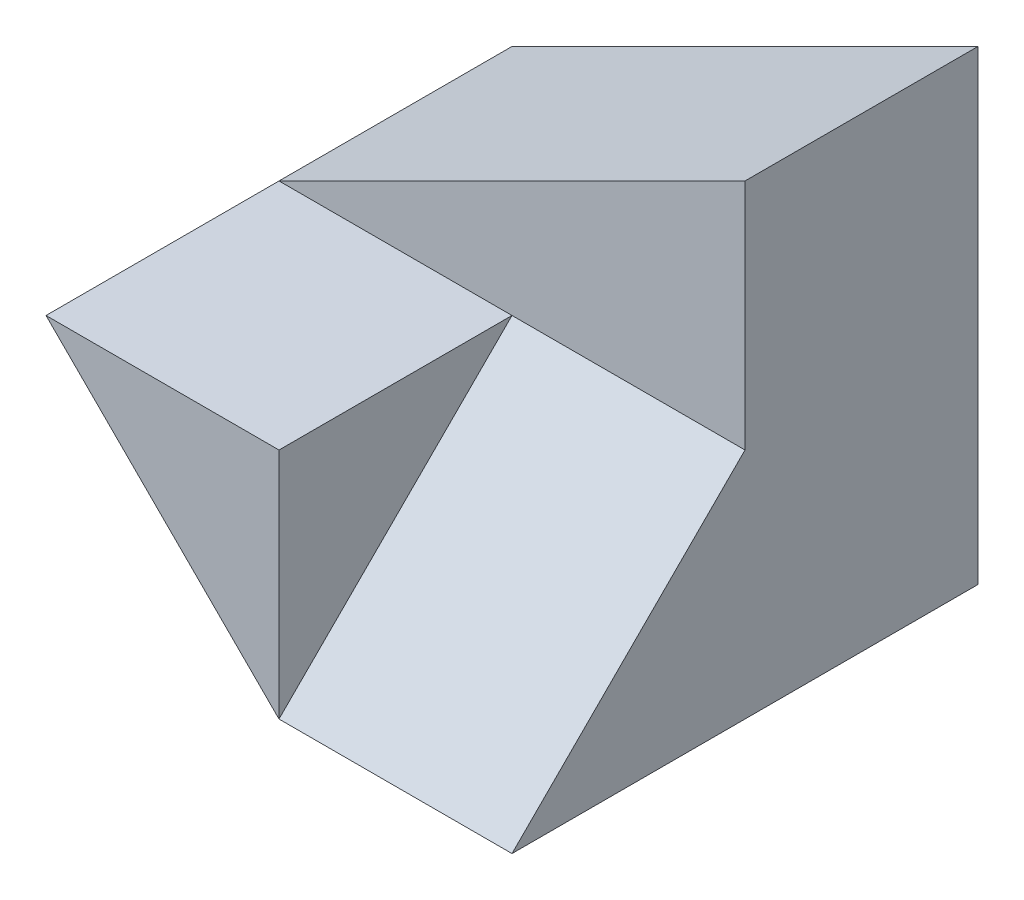
ISO-10303-21;
HEADER;
FILE_DESCRIPTION(('STEP AP214'),'2;1');
FILE_NAME('part.step','',(''),(''),'','','');
FILE_SCHEMA(('AUTOMOTIVE_DESIGN { 1 0 10303 214 1 1 1 1 }'));
ENDSEC;
DATA;
#1=APPLICATION_CONTEXT('core data for automotive mechanical design processes');
#2=APPLICATION_PROTOCOL_DEFINITION('international standard','automotive_design',2000,#1);
#3=PRODUCT_CONTEXT('',#1,'mechanical');
#4=PRODUCT('Part','Part','',(#3));
#5=PRODUCT_RELATED_PRODUCT_CATEGORY('part','',(#4));
#6=PRODUCT_DEFINITION_FORMATION('','',#4);
#7=PRODUCT_DEFINITION_CONTEXT('part definition',#1,'design');
#8=PRODUCT_DEFINITION('design','',#6,#7);
#9=PRODUCT_DEFINITION_SHAPE('','',#8);
#10=(LENGTH_UNIT() NAMED_UNIT(*) SI_UNIT(.MILLI.,.METRE.));
#11=(NAMED_UNIT(*) PLANE_ANGLE_UNIT() SI_UNIT($,.RADIAN.));
#12=(NAMED_UNIT(*) SI_UNIT($,.STERADIAN.) SOLID_ANGLE_UNIT());
#13=UNCERTAINTY_MEASURE_WITH_UNIT(LENGTH_MEASURE(1.E-05),#10,'distance_accuracy_value','');
#14=(GEOMETRIC_REPRESENTATION_CONTEXT(3) GLOBAL_UNCERTAINTY_ASSIGNED_CONTEXT((#13)) GLOBAL_UNIT_ASSIGNED_CONTEXT((#10,
#11,#12)) REPRESENTATION_CONTEXT('',''));
#15=CARTESIAN_POINT('',(0.,0.,0.));
#16=DIRECTION('',(0.,0.,1.));
#17=DIRECTION('',(1.,0.,0.));
#18=AXIS2_PLACEMENT_3D('',#15,#16,#17);
#19=CARTESIAN_POINT('',(0.,0.,40.));
#20=DIRECTION('',(0.,0.,-1.));
#21=DIRECTION('',(-1.,0.,0.));
#22=AXIS2_PLACEMENT_3D('',#19,#20,#21);
#23=PLANE('',#22);
#24=DIRECTION('',(0.,-1.,0.));
#25=VECTOR('',#24,1.);
#26=CARTESIAN_POINT('',(20.,0.,40.));
#27=LINE('',#26,#25);
#28=CARTESIAN_POINT('',(20.,20.,40.));
#29=VERTEX_POINT('',#28);
#30=CARTESIAN_POINT('',(20.,0.,40.));
#31=VERTEX_POINT('',#30);
#32=EDGE_CURVE('E88',#29,#31,#27,.T.);
#33=ORIENTED_EDGE('',*,*,#32,.F.);
#34=DIRECTION('',(1.,0.,0.));
#35=VECTOR('',#34,1.);
#36=CARTESIAN_POINT('',(0.,20.,40.));
#37=LINE('',#36,#35);
#38=CARTESIAN_POINT('',(0.,20.,40.));
#39=VERTEX_POINT('',#38);
#40=EDGE_CURVE('E98',#39,#29,#37,.T.);
#41=ORIENTED_EDGE('',*,*,#40,.F.);
#42=DIRECTION('',(-0.707106781186548,0.707106781186547,0.));
#43=VECTOR('',#42,1.);
#44=CARTESIAN_POINT('',(0.,20.,40.));
#45=LINE('',#44,#43);
#46=EDGE_CURVE('E99',#31,#39,#45,.T.);
#47=ORIENTED_EDGE('',*,*,#46,.F.);
#48=EDGE_LOOP('',(#33,#41,#47));
#49=FACE_BOUND('',#48,.T.);
#50=ADVANCED_FACE('F33',(#49),#23,.F.);
#51=CARTESIAN_POINT('',(0.,20.,40.));
#52=DIRECTION('',(0.,-1.,0.));
#53=DIRECTION('',(0.,0.,-1.));
#54=AXIS2_PLACEMENT_3D('',#51,#52,#53);
#55=PLANE('',#54);
#56=DIRECTION('',(0.,0.,1.));
#57=VECTOR('',#56,1.);
#58=CARTESIAN_POINT('',(20.,20.,40.));
#59=LINE('',#58,#57);
#60=CARTESIAN_POINT('',(20.,20.,20.));
#61=VERTEX_POINT('',#60);
#62=EDGE_CURVE('E85',#61,#29,#59,.T.);
#63=ORIENTED_EDGE('',*,*,#62,.F.);
#64=DIRECTION('',(1.,0.,0.));
#65=VECTOR('',#64,1.);
#66=CARTESIAN_POINT('',(0.,20.,20.));
#67=LINE('',#66,#65);
#68=CARTESIAN_POINT('',(0.,20.,20.));
#69=VERTEX_POINT('',#68);
#70=EDGE_CURVE('E105',#69,#61,#67,.T.);
#71=ORIENTED_EDGE('',*,*,#70,.F.);
#72=DIRECTION('',(0.,0.,-1.));
#73=VECTOR('',#72,1.);
#74=CARTESIAN_POINT('',(0.,20.,40.));
#75=LINE('',#74,#73);
#76=EDGE_CURVE('E104',#39,#69,#75,.T.);
#77=ORIENTED_EDGE('',*,*,#76,.F.);
#78=ORIENTED_EDGE('',*,*,#40,.T.);
#79=EDGE_LOOP('',(#63,#71,#77,#78));
#80=FACE_BOUND('',#79,.T.);
#81=ADVANCED_FACE('F103',(#80),#55,.F.);
#82=CARTESIAN_POINT('',(0.,0.,40.));
#83=DIRECTION('',(0.,1.,0.));
#84=DIRECTION('',(0.,0.,1.));
#85=AXIS2_PLACEMENT_3D('',#82,#83,#84);
#86=PLANE('',#85);
#87=DIRECTION('',(1.,0.,0.));
#88=VECTOR('',#87,1.);
#89=CARTESIAN_POINT('',(0.,0.,40.));
#90=LINE('',#89,#88);
#91=CARTESIAN_POINT('',(40.,0.,40.));
#92=VERTEX_POINT('',#91);
#93=EDGE_CURVE('E118',#31,#92,#90,.T.);
#94=ORIENTED_EDGE('',*,*,#93,.F.);
#95=DIRECTION('',(0.,0.,1.));
#96=VECTOR('',#95,1.);
#97=CARTESIAN_POINT('',(20.,0.,0.));
#98=LINE('',#97,#96);
#99=CARTESIAN_POINT('',(20.,0.,0.));
#100=VERTEX_POINT('',#99);
#101=EDGE_CURVE('E147',#100,#31,#98,.T.);
#102=ORIENTED_EDGE('',*,*,#101,.F.);
#103=DIRECTION('',(1.,0.,0.));
#104=VECTOR('',#103,1.);
#105=CARTESIAN_POINT('',(0.,0.,0.));
#106=LINE('',#105,#104);
#107=CARTESIAN_POINT('',(40.,0.,0.));
#108=VERTEX_POINT('',#107);
#109=EDGE_CURVE('E117',#100,#108,#106,.T.);
#110=ORIENTED_EDGE('',*,*,#109,.T.);
#111=DIRECTION('',(0.,0.,-1.));
#112=VECTOR('',#111,1.);
#113=CARTESIAN_POINT('',(40.,0.,40.));
#114=LINE('',#113,#112);
#115=EDGE_CURVE('E41',#92,#108,#114,.T.);
#116=ORIENTED_EDGE('',*,*,#115,.F.);
#117=EDGE_LOOP('',(#94,#102,#110,#116));
#118=FACE_BOUND('',#117,.T.);
#119=ADVANCED_FACE('F35',(#118),#86,.F.);
#120=CARTESIAN_POINT('',(40.,0.,40.));
#121=DIRECTION('',(-1.,0.,0.));
#122=DIRECTION('',(0.,0.,1.));
#123=AXIS2_PLACEMENT_3D('',#120,#121,#122);
#124=PLANE('',#123);
#125=DIRECTION('',(0.,1.,0.));
#126=VECTOR('',#125,1.);
#127=CARTESIAN_POINT('',(40.,40.,20.));
#128=LINE('',#127,#126);
#129=CARTESIAN_POINT('',(40.,20.,20.));
#130=VERTEX_POINT('',#129);
#131=CARTESIAN_POINT('',(40.,40.,20.));
#132=VERTEX_POINT('',#131);
#133=EDGE_CURVE('E109',#130,#132,#128,.T.);
#134=ORIENTED_EDGE('',*,*,#133,.F.);
#135=DIRECTION('',(0.,0.707106781186547,-0.707106781186548));
#136=VECTOR('',#135,1.);
#137=CARTESIAN_POINT('',(40.,20.,20.));
#138=LINE('',#137,#136);
#139=EDGE_CURVE('E93',#92,#130,#138,.T.);
#140=ORIENTED_EDGE('',*,*,#139,.F.);
#141=ORIENTED_EDGE('',*,*,#115,.T.);
#142=DIRECTION('',(0.,1.,0.));
#143=VECTOR('',#142,1.);
#144=CARTESIAN_POINT('',(40.,0.,0.));
#145=LINE('',#144,#143);
#146=CARTESIAN_POINT('',(40.,40.,0.));
#147=VERTEX_POINT('',#146);
#148=EDGE_CURVE('E120',#108,#147,#145,.T.);
#149=ORIENTED_EDGE('',*,*,#148,.T.);
#150=DIRECTION('',(0.,0.,-1.));
#151=VECTOR('',#150,1.);
#152=CARTESIAN_POINT('',(40.,40.,40.));
#153=LINE('',#152,#151);
#154=EDGE_CURVE('E55',#132,#147,#153,.T.);
#155=ORIENTED_EDGE('',*,*,#154,.F.);
#156=EDGE_LOOP('',(#134,#140,#141,#149,#155));
#157=FACE_BOUND('',#156,.T.);
#158=ADVANCED_FACE('F130',(#157),#124,.F.);
#159=CARTESIAN_POINT('',(0.,0.,0.));
#160=DIRECTION('',(0.,0.,-1.));
#161=DIRECTION('',(-1.,0.,0.));
#162=AXIS2_PLACEMENT_3D('',#159,#160,#161);
#163=PLANE('',#162);
#164=DIRECTION('',(-0.707106781186548,0.707106781186547,0.));
#165=VECTOR('',#164,1.);
#166=CARTESIAN_POINT('',(0.,20.,0.));
#167=LINE('',#166,#165);
#168=CARTESIAN_POINT('',(0.,20.,0.));
#169=VERTEX_POINT('',#168);
#170=EDGE_CURVE('E136',#100,#169,#167,.T.);
#171=ORIENTED_EDGE('',*,*,#170,.T.);
#172=DIRECTION('',(0.894427190999916,0.447213595499958,0.));
#173=VECTOR('',#172,1.);
#174=CARTESIAN_POINT('',(0.,20.,0.));
#175=LINE('',#174,#173);
#176=EDGE_CURVE('E107',#169,#147,#175,.T.);
#177=ORIENTED_EDGE('',*,*,#176,.T.);
#178=ORIENTED_EDGE('',*,*,#148,.F.);
#179=ORIENTED_EDGE('',*,*,#109,.F.);
#180=EDGE_LOOP('',(#171,#177,#178,#179));
#181=FACE_BOUND('',#180,.T.);
#182=ADVANCED_FACE('F135',(#181),#163,.T.);
#183=CARTESIAN_POINT('',(0.,20.,0.));
#184=DIRECTION('',(0.447213595499958,-0.894427190999916,0.));
#185=DIRECTION('',(0.894427190999916,0.447213595499958,0.));
#186=AXIS2_PLACEMENT_3D('',#183,#184,#185);
#187=PLANE('',#186);
#188=DIRECTION('',(0.,0.,1.));
#189=VECTOR('',#188,1.);
#190=CARTESIAN_POINT('',(0.,20.,0.));
#191=LINE('',#190,#189);
#192=EDGE_CURVE('E114',#169,#69,#191,.T.);
#193=ORIENTED_EDGE('',*,*,#192,.T.);
#194=DIRECTION('',(0.894427190999916,0.447213595499958,0.));
#195=VECTOR('',#194,1.);
#196=CARTESIAN_POINT('',(0.,20.,20.));
#197=LINE('',#196,#195);
#198=EDGE_CURVE('E11',#69,#132,#197,.T.);
#199=ORIENTED_EDGE('',*,*,#198,.T.);
#200=ORIENTED_EDGE('',*,*,#154,.T.);
#201=ORIENTED_EDGE('',*,*,#176,.F.);
#202=EDGE_LOOP('',(#193,#199,#200,#201));
#203=FACE_BOUND('',#202,.T.);
#204=ADVANCED_FACE('F137',(#203),#187,.F.);
#205=CARTESIAN_POINT('',(0.,40.,20.));
#206=DIRECTION('',(0.,0.,-1.));
#207=DIRECTION('',(0.,1.,0.));
#208=AXIS2_PLACEMENT_3D('',#205,#206,#207);
#209=PLANE('',#208);
#210=ORIENTED_EDGE('',*,*,#70,.T.);
#211=DIRECTION('',(1.,0.,0.));
#212=VECTOR('',#211,1.);
#213=CARTESIAN_POINT('',(20.,20.,20.));
#214=LINE('',#213,#212);
#215=EDGE_CURVE('E146',#61,#130,#214,.T.);
#216=ORIENTED_EDGE('',*,*,#215,.T.);
#217=ORIENTED_EDGE('',*,*,#133,.T.);
#218=ORIENTED_EDGE('',*,*,#198,.F.);
#219=EDGE_LOOP('',(#210,#216,#217,#218));
#220=FACE_BOUND('',#219,.T.);
#221=ADVANCED_FACE('F145',(#220),#209,.F.);
#222=CARTESIAN_POINT('',(0.,20.,0.));
#223=DIRECTION('',(0.707106781186547,0.707106781186548,0.));
#224=DIRECTION('',(-0.707106781186548,0.707106781186547,0.));
#225=AXIS2_PLACEMENT_3D('',#222,#223,#224);
#226=PLANE('',#225);
#227=ORIENTED_EDGE('',*,*,#46,.T.);
#228=ORIENTED_EDGE('',*,*,#76,.T.);
#229=ORIENTED_EDGE('',*,*,#192,.F.);
#230=ORIENTED_EDGE('',*,*,#170,.F.);
#231=ORIENTED_EDGE('',*,*,#101,.T.);
#232=EDGE_LOOP('',(#227,#228,#229,#230,#231));
#233=FACE_BOUND('',#232,.T.);
#234=ADVANCED_FACE('F140',(#233),#226,.F.);
#235=CARTESIAN_POINT('',(20.,20.,20.));
#236=DIRECTION('',(0.,-0.707106781186548,-0.707106781186547));
#237=DIRECTION('',(0.,0.707106781186547,-0.707106781186548));
#238=AXIS2_PLACEMENT_3D('',#235,#236,#237);
#239=PLANE('',#238);
#240=ORIENTED_EDGE('',*,*,#139,.T.);
#241=ORIENTED_EDGE('',*,*,#215,.F.);
#242=DIRECTION('',(0.,0.707106781186547,-0.707106781186548));
#243=VECTOR('',#242,1.);
#244=CARTESIAN_POINT('',(20.,20.,20.));
#245=LINE('',#244,#243);
#246=EDGE_CURVE('E48',#31,#61,#245,.T.);
#247=ORIENTED_EDGE('',*,*,#246,.F.);
#248=ORIENTED_EDGE('',*,*,#93,.T.);
#249=EDGE_LOOP('',(#240,#241,#247,#248));
#250=FACE_BOUND('',#249,.T.);
#251=ADVANCED_FACE('F155',(#250),#239,.F.);
#252=CARTESIAN_POINT('',(20.,0.,0.));
#253=DIRECTION('',(1.,0.,0.));
#254=DIRECTION('',(0.,0.,-1.));
#255=AXIS2_PLACEMENT_3D('',#252,#253,#254);
#256=PLANE('',#255);
#257=ORIENTED_EDGE('',*,*,#62,.T.);
#258=ORIENTED_EDGE('',*,*,#32,.T.);
#259=ORIENTED_EDGE('',*,*,#246,.T.);
#260=EDGE_LOOP('',(#257,#258,#259));
#261=FACE_BOUND('',#260,.T.);
#262=ADVANCED_FACE('F87',(#261),#256,.T.);
#263=CLOSED_SHELL('',(#50,#81,#119,#158,#182,#204,#221,#234,#251,#262));
#264=MANIFOLD_SOLID_BREP('B2',#263);
#265=ADVANCED_BREP_SHAPE_REPRESENTATION('',(#18,#264),#14);
#266=SHAPE_DEFINITION_REPRESENTATION(#9,#265);
ENDSEC;
END-ISO-10303-21;
